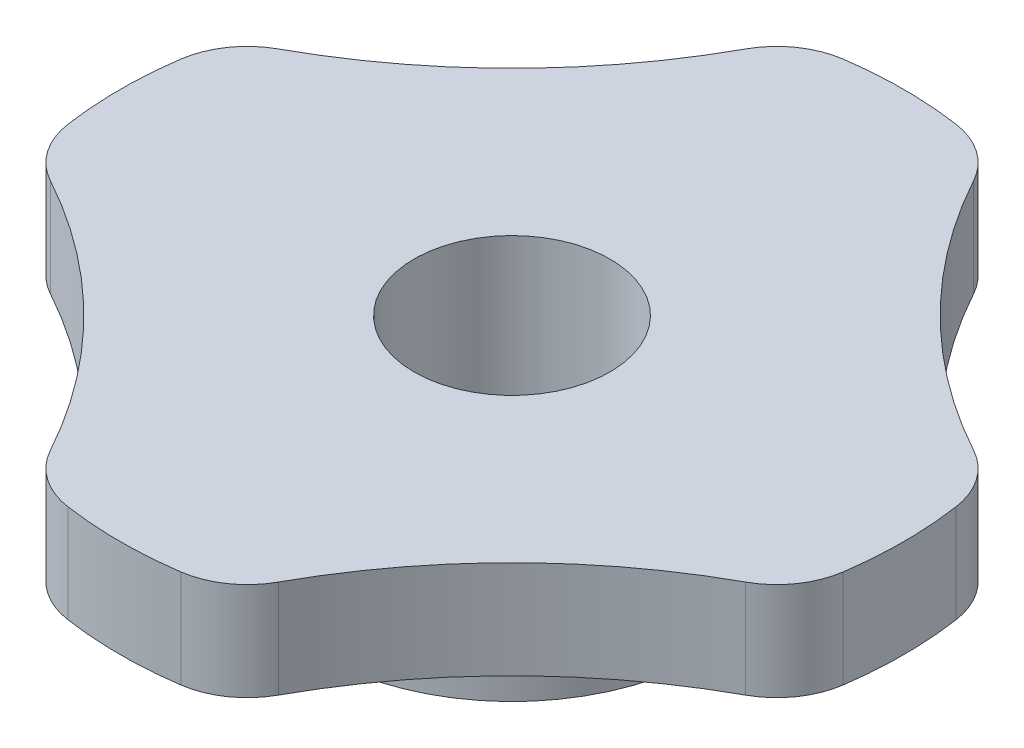
ISO-10303-21;
HEADER;
FILE_DESCRIPTION(('STEP AP214'),'2;1');
FILE_NAME('part.step','',(''),(''),'','','');
FILE_SCHEMA(('AUTOMOTIVE_DESIGN { 1 0 10303 214 1 1 1 1 }'));
ENDSEC;
DATA;
#1=APPLICATION_CONTEXT('core data for automotive mechanical design processes');
#2=APPLICATION_PROTOCOL_DEFINITION('international standard','automotive_design',2000,#1);
#3=PRODUCT_CONTEXT('',#1,'mechanical');
#4=PRODUCT('Part','Part','',(#3));
#5=PRODUCT_RELATED_PRODUCT_CATEGORY('part','',(#4));
#6=PRODUCT_DEFINITION_FORMATION('','',#4);
#7=PRODUCT_DEFINITION_CONTEXT('part definition',#1,'design');
#8=PRODUCT_DEFINITION('design','',#6,#7);
#9=PRODUCT_DEFINITION_SHAPE('','',#8);
#10=(LENGTH_UNIT() NAMED_UNIT(*) SI_UNIT(.MILLI.,.METRE.));
#11=(NAMED_UNIT(*) PLANE_ANGLE_UNIT() SI_UNIT($,.RADIAN.));
#12=(NAMED_UNIT(*) SI_UNIT($,.STERADIAN.) SOLID_ANGLE_UNIT());
#13=UNCERTAINTY_MEASURE_WITH_UNIT(LENGTH_MEASURE(1.E-05),#10,'distance_accuracy_value','');
#14=(GEOMETRIC_REPRESENTATION_CONTEXT(3) GLOBAL_UNCERTAINTY_ASSIGNED_CONTEXT((#13)) GLOBAL_UNIT_ASSIGNED_CONTEXT((#10,
#11,#12)) REPRESENTATION_CONTEXT('',''));
#15=CARTESIAN_POINT('',(0.,0.,0.));
#16=DIRECTION('',(0.,0.,1.));
#17=DIRECTION('',(1.,0.,0.));
#18=AXIS2_PLACEMENT_3D('',#15,#16,#17);
#19=CARTESIAN_POINT('',(0.,3.175,0.));
#20=DIRECTION('',(0.,-1.,0.));
#21=DIRECTION('',(0.,0.,-1.));
#22=AXIS2_PLACEMENT_3D('',#19,#20,#21);
#23=CYLINDRICAL_SURFACE('',#22,12.7);
#24=CARTESIAN_POINT('',(0.,3.175,0.));
#25=DIRECTION('',(0.,1.,0.));
#26=DIRECTION('',(0.,0.,1.));
#27=AXIS2_PLACEMENT_3D('',#24,#25,#26);
#28=CIRCLE('',#27,12.7);
#29=CARTESIAN_POINT('',(1.83384169491819,3.175,-12.566901950679));
#30=VERTEX_POINT('',#29);
#31=CARTESIAN_POINT('',(-1.83384169491815,3.175,-12.566901950679));
#32=VERTEX_POINT('',#31);
#33=EDGE_CURVE('E187',#30,#32,#28,.T.);
#34=ORIENTED_EDGE('',*,*,#33,.F.);
#35=DIRECTION('',(0.,-1.,0.));
#36=VECTOR('',#35,1.);
#37=CARTESIAN_POINT('',(1.83384169491819,3.175,-12.566901950679));
#38=LINE('',#37,#36);
#39=CARTESIAN_POINT('',(1.83384169491819,0.,-12.566901950679));
#40=VERTEX_POINT('',#39);
#41=EDGE_CURVE('E11',#30,#40,#38,.T.);
#42=ORIENTED_EDGE('',*,*,#41,.T.);
#43=CARTESIAN_POINT('',(0.,0.,0.));
#44=DIRECTION('',(0.,1.,0.));
#45=DIRECTION('',(0.,0.,1.));
#46=AXIS2_PLACEMENT_3D('',#43,#44,#45);
#47=CIRCLE('',#46,12.7);
#48=CARTESIAN_POINT('',(-1.83384169491815,0.,-12.566901950679));
#49=VERTEX_POINT('',#48);
#50=EDGE_CURVE('E287',#40,#49,#47,.T.);
#51=ORIENTED_EDGE('',*,*,#50,.T.);
#52=DIRECTION('',(0.,-1.,0.));
#53=VECTOR('',#52,1.);
#54=CARTESIAN_POINT('',(-1.83384169491815,3.175,-12.566901950679));
#55=LINE('',#54,#53);
#56=EDGE_CURVE('E50',#49,#32,#55,.F.);
#57=ORIENTED_EDGE('',*,*,#56,.T.);
#58=EDGE_LOOP('',(#34,#42,#51,#57));
#59=FACE_BOUND('',#58,.T.);
#60=ADVANCED_FACE('F41',(#59),#23,.T.);
#61=CARTESIAN_POINT('',(-20.4106311338721,3.175,-20.4106311338721));
#62=DIRECTION('',(0.,-1.,0.));
#63=DIRECTION('',(0.,0.,-1.));
#64=AXIS2_PLACEMENT_3D('',#61,#62,#63);
#65=CYLINDRICAL_SURFACE('',#64,19.05);
#66=CARTESIAN_POINT('',(-20.4106311338721,0.,-20.4106311338721));
#67=DIRECTION('',(0.,1.,0.));
#68=DIRECTION('',(0.,0.,1.));
#69=AXIS2_PLACEMENT_3D('',#66,#67,#68);
#70=CIRCLE('',#69,19.05);
#71=CARTESIAN_POINT('',(-3.69572721216247,0.,-11.2720050397584));
#72=VERTEX_POINT('',#71);
#73=CARTESIAN_POINT('',(-11.2720050397584,0.,-3.69572721216247));
#74=VERTEX_POINT('',#73);
#75=EDGE_CURVE('E301',#72,#74,#70,.F.);
#76=ORIENTED_EDGE('',*,*,#75,.T.);
#77=DIRECTION('',(0.,-1.,0.));
#78=VECTOR('',#77,1.);
#79=CARTESIAN_POINT('',(-11.2720050397584,3.175,-3.69572721216247));
#80=LINE('',#79,#78);
#81=CARTESIAN_POINT('',(-11.2720050397584,3.175,-3.69572721216247));
#82=VERTEX_POINT('',#81);
#83=EDGE_CURVE('E279',#74,#82,#80,.F.);
#84=ORIENTED_EDGE('',*,*,#83,.T.);
#85=CARTESIAN_POINT('',(-20.4106311338721,3.175,-20.4106311338721));
#86=DIRECTION('',(0.,1.,0.));
#87=DIRECTION('',(0.,0.,1.));
#88=AXIS2_PLACEMENT_3D('',#85,#86,#87);
#89=CIRCLE('',#88,19.05);
#90=CARTESIAN_POINT('',(-3.69572721216247,3.175,-11.2720050397584));
#91=VERTEX_POINT('',#90);
#92=EDGE_CURVE('E193',#91,#82,#89,.F.);
#93=ORIENTED_EDGE('',*,*,#92,.F.);
#94=DIRECTION('',(0.,-1.,0.));
#95=VECTOR('',#94,1.);
#96=CARTESIAN_POINT('',(-3.69572721216247,3.175,-11.2720050397584));
#97=LINE('',#96,#95);
#98=EDGE_CURVE('E275',#91,#72,#97,.T.);
#99=ORIENTED_EDGE('',*,*,#98,.T.);
#100=EDGE_LOOP('',(#76,#84,#93,#99));
#101=FACE_BOUND('',#100,.T.);
#102=ADVANCED_FACE('F300',(#101),#65,.F.);
#103=CARTESIAN_POINT('',(0.,3.175,0.));
#104=DIRECTION('',(0.,-1.,0.));
#105=DIRECTION('',(0.,0.,-1.));
#106=AXIS2_PLACEMENT_3D('',#103,#104,#105);
#107=CYLINDRICAL_SURFACE('',#106,12.7);
#108=CARTESIAN_POINT('',(0.,0.,0.));
#109=DIRECTION('',(0.,1.,0.));
#110=DIRECTION('',(0.,0.,1.));
#111=AXIS2_PLACEMENT_3D('',#108,#109,#110);
#112=CIRCLE('',#111,12.7);
#113=CARTESIAN_POINT('',(-12.566901950679,0.,-1.83384169491815));
#114=VERTEX_POINT('',#113);
#115=CARTESIAN_POINT('',(-12.566901950679,0.,1.83384169491801));
#116=VERTEX_POINT('',#115);
#117=EDGE_CURVE('E305',#114,#116,#112,.T.);
#118=ORIENTED_EDGE('',*,*,#117,.T.);
#119=DIRECTION('',(0.,-1.,0.));
#120=VECTOR('',#119,1.);
#121=CARTESIAN_POINT('',(-12.566901950679,3.175,1.83384169491801));
#122=LINE('',#121,#120);
#123=CARTESIAN_POINT('',(-12.566901950679,3.175,1.83384169491801));
#124=VERTEX_POINT('',#123);
#125=EDGE_CURVE('E272',#116,#124,#122,.F.);
#126=ORIENTED_EDGE('',*,*,#125,.T.);
#127=CARTESIAN_POINT('',(0.,3.175,0.));
#128=DIRECTION('',(0.,1.,0.));
#129=DIRECTION('',(0.,0.,1.));
#130=AXIS2_PLACEMENT_3D('',#127,#128,#129);
#131=CIRCLE('',#130,12.7);
#132=CARTESIAN_POINT('',(-12.566901950679,3.175,-1.83384169491815));
#133=VERTEX_POINT('',#132);
#134=EDGE_CURVE('E583',#133,#124,#131,.T.);
#135=ORIENTED_EDGE('',*,*,#134,.F.);
#136=DIRECTION('',(0.,-1.,0.));
#137=VECTOR('',#136,1.);
#138=CARTESIAN_POINT('',(-12.566901950679,3.175,-1.83384169491815));
#139=LINE('',#138,#137);
#140=EDGE_CURVE('E268',#133,#114,#139,.T.);
#141=ORIENTED_EDGE('',*,*,#140,.T.);
#142=EDGE_LOOP('',(#118,#126,#135,#141));
#143=FACE_BOUND('',#142,.T.);
#144=ADVANCED_FACE('F365',(#143),#107,.T.);
#145=CARTESIAN_POINT('',(-20.4106311338723,3.175,20.4106311338719));
#146=DIRECTION('',(0.,-1.,0.));
#147=DIRECTION('',(0.,0.,-1.));
#148=AXIS2_PLACEMENT_3D('',#145,#146,#147);
#149=CYLINDRICAL_SURFACE('',#148,19.05);
#150=CARTESIAN_POINT('',(-20.4106311338723,0.,20.4106311338719));
#151=DIRECTION('',(0.,1.,0.));
#152=DIRECTION('',(0.,0.,1.));
#153=AXIS2_PLACEMENT_3D('',#150,#151,#152);
#154=CIRCLE('',#153,19.05);
#155=CARTESIAN_POINT('',(-11.2720050397584,0.,3.69572721216234));
#156=VERTEX_POINT('',#155);
#157=CARTESIAN_POINT('',(-3.69572721216258,0.,11.2720050397583));
#158=VERTEX_POINT('',#157);
#159=EDGE_CURVE('E310',#156,#158,#154,.F.);
#160=ORIENTED_EDGE('',*,*,#159,.T.);
#161=DIRECTION('',(0.,-1.,0.));
#162=VECTOR('',#161,1.);
#163=CARTESIAN_POINT('',(-3.69572721216258,3.175,11.2720050397583));
#164=LINE('',#163,#162);
#165=CARTESIAN_POINT('',(-3.69572721216258,3.175,11.2720050397583));
#166=VERTEX_POINT('',#165);
#167=EDGE_CURVE('E265',#158,#166,#164,.F.);
#168=ORIENTED_EDGE('',*,*,#167,.T.);
#169=CARTESIAN_POINT('',(-20.4106311338723,3.175,20.4106311338719));
#170=DIRECTION('',(0.,1.,0.));
#171=DIRECTION('',(0.,0.,1.));
#172=AXIS2_PLACEMENT_3D('',#169,#170,#171);
#173=CIRCLE('',#172,19.05);
#174=CARTESIAN_POINT('',(-11.2720050397584,3.175,3.69572721216234));
#175=VERTEX_POINT('',#174);
#176=EDGE_CURVE('E587',#175,#166,#173,.F.);
#177=ORIENTED_EDGE('',*,*,#176,.F.);
#178=DIRECTION('',(0.,-1.,0.));
#179=VECTOR('',#178,1.);
#180=CARTESIAN_POINT('',(-11.2720050397584,3.175,3.69572721216234));
#181=LINE('',#180,#179);
#182=EDGE_CURVE('E261',#175,#156,#181,.T.);
#183=ORIENTED_EDGE('',*,*,#182,.T.);
#184=EDGE_LOOP('',(#160,#168,#177,#183));
#185=FACE_BOUND('',#184,.T.);
#186=ADVANCED_FACE('F489',(#185),#149,.F.);
#187=CARTESIAN_POINT('',(0.,3.175,0.));
#188=DIRECTION('',(0.,-1.,0.));
#189=DIRECTION('',(0.,0.,-1.));
#190=AXIS2_PLACEMENT_3D('',#187,#188,#189);
#191=CYLINDRICAL_SURFACE('',#190,12.7);
#192=CARTESIAN_POINT('',(0.,0.,0.));
#193=DIRECTION('',(0.,1.,0.));
#194=DIRECTION('',(0.,0.,1.));
#195=AXIS2_PLACEMENT_3D('',#192,#193,#194);
#196=CIRCLE('',#195,12.7);
#197=CARTESIAN_POINT('',(-1.83384169491827,0.,12.566901950679));
#198=VERTEX_POINT('',#197);
#199=CARTESIAN_POINT('',(1.83384169491842,0.,12.566901950679));
#200=VERTEX_POINT('',#199);
#201=EDGE_CURVE('E319',#198,#200,#196,.T.);
#202=ORIENTED_EDGE('',*,*,#201,.T.);
#203=DIRECTION('',(0.,-1.,0.));
#204=VECTOR('',#203,1.);
#205=CARTESIAN_POINT('',(1.83384169491842,3.175,12.566901950679));
#206=LINE('',#205,#204);
#207=CARTESIAN_POINT('',(1.83384169491842,3.175,12.566901950679));
#208=VERTEX_POINT('',#207);
#209=EDGE_CURVE('E258',#200,#208,#206,.F.);
#210=ORIENTED_EDGE('',*,*,#209,.T.);
#211=CARTESIAN_POINT('',(0.,3.175,0.));
#212=DIRECTION('',(0.,1.,0.));
#213=DIRECTION('',(0.,0.,1.));
#214=AXIS2_PLACEMENT_3D('',#211,#212,#213);
#215=CIRCLE('',#214,12.7);
#216=CARTESIAN_POINT('',(-1.83384169491827,3.175,12.566901950679));
#217=VERTEX_POINT('',#216);
#218=EDGE_CURVE('E340',#217,#208,#215,.T.);
#219=ORIENTED_EDGE('',*,*,#218,.F.);
#220=DIRECTION('',(0.,-1.,0.));
#221=VECTOR('',#220,1.);
#222=CARTESIAN_POINT('',(-1.83384169491827,3.175,12.566901950679));
#223=LINE('',#222,#221);
#224=EDGE_CURVE('E254',#217,#198,#223,.T.);
#225=ORIENTED_EDGE('',*,*,#224,.T.);
#226=EDGE_LOOP('',(#202,#210,#219,#225));
#227=FACE_BOUND('',#226,.T.);
#228=ADVANCED_FACE('F480',(#227),#191,.T.);
#229=CARTESIAN_POINT('',(20.4106311338728,3.175,20.4106311338719));
#230=DIRECTION('',(0.,-1.,0.));
#231=DIRECTION('',(0.,0.,-1.));
#232=AXIS2_PLACEMENT_3D('',#229,#230,#231);
#233=CYLINDRICAL_SURFACE('',#232,19.0500000000004);
#234=CARTESIAN_POINT('',(20.4106311338728,0.,20.4106311338719));
#235=DIRECTION('',(0.,1.,0.));
#236=DIRECTION('',(0.,0.,1.));
#237=AXIS2_PLACEMENT_3D('',#234,#235,#236);
#238=CIRCLE('',#237,19.0500000000004);
#239=CARTESIAN_POINT('',(3.6957272121627,0.,11.2720050397583));
#240=VERTEX_POINT('',#239);
#241=CARTESIAN_POINT('',(11.2720050397585,0.,3.69572721216222));
#242=VERTEX_POINT('',#241);
#243=EDGE_CURVE('E195',#240,#242,#238,.F.);
#244=ORIENTED_EDGE('',*,*,#243,.T.);
#245=DIRECTION('',(0.,-1.,0.));
#246=VECTOR('',#245,1.);
#247=CARTESIAN_POINT('',(11.2720050397585,3.175,3.69572721216221));
#248=LINE('',#247,#246);
#249=CARTESIAN_POINT('',(11.2720050397585,3.175,3.69572721216222));
#250=VERTEX_POINT('',#249);
#251=EDGE_CURVE('E57',#242,#250,#248,.F.);
#252=ORIENTED_EDGE('',*,*,#251,.T.);
#253=CARTESIAN_POINT('',(20.4106311338728,3.175,20.4106311338719));
#254=DIRECTION('',(0.,1.,0.));
#255=DIRECTION('',(0.,0.,1.));
#256=AXIS2_PLACEMENT_3D('',#253,#254,#255);
#257=CIRCLE('',#256,19.0500000000004);
#258=CARTESIAN_POINT('',(3.6957272121627,3.175,11.2720050397583));
#259=VERTEX_POINT('',#258);
#260=EDGE_CURVE('E332',#259,#250,#257,.F.);
#261=ORIENTED_EDGE('',*,*,#260,.F.);
#262=DIRECTION('',(0.,-1.,0.));
#263=VECTOR('',#262,1.);
#264=CARTESIAN_POINT('',(3.6957272121627,3.175,11.2720050397583));
#265=LINE('',#264,#263);
#266=EDGE_CURVE('E248',#259,#240,#265,.T.);
#267=ORIENTED_EDGE('',*,*,#266,.T.);
#268=EDGE_LOOP('',(#244,#252,#261,#267));
#269=FACE_BOUND('',#268,.T.);
#270=ADVANCED_FACE('F324',(#269),#233,.F.);
#271=CARTESIAN_POINT('',(0.,3.175,0.));
#272=DIRECTION('',(0.,-1.,0.));
#273=DIRECTION('',(0.,0.,-1.));
#274=AXIS2_PLACEMENT_3D('',#271,#272,#273);
#275=CYLINDRICAL_SURFACE('',#274,12.7);
#276=CARTESIAN_POINT('',(0.,0.,0.));
#277=DIRECTION('',(0.,1.,0.));
#278=DIRECTION('',(0.,0.,1.));
#279=AXIS2_PLACEMENT_3D('',#276,#277,#278);
#280=CIRCLE('',#279,12.7);
#281=CARTESIAN_POINT('',(12.566901950679,0.,1.83384169491787));
#282=VERTEX_POINT('',#281);
#283=CARTESIAN_POINT('',(12.566901950679,0.,-1.8338416949181));
#284=VERTEX_POINT('',#283);
#285=EDGE_CURVE('E188',#282,#284,#280,.T.);
#286=ORIENTED_EDGE('',*,*,#285,.T.);
#287=DIRECTION('',(0.,-1.,0.));
#288=VECTOR('',#287,1.);
#289=CARTESIAN_POINT('',(12.566901950679,3.175,-1.8338416949181));
#290=LINE('',#289,#288);
#291=CARTESIAN_POINT('',(12.566901950679,3.175,-1.8338416949181));
#292=VERTEX_POINT('',#291);
#293=EDGE_CURVE('E162',#284,#292,#290,.F.);
#294=ORIENTED_EDGE('',*,*,#293,.T.);
#295=CARTESIAN_POINT('',(0.,3.175,0.));
#296=DIRECTION('',(0.,1.,0.));
#297=DIRECTION('',(0.,0.,1.));
#298=AXIS2_PLACEMENT_3D('',#295,#296,#297);
#299=CIRCLE('',#298,12.7);
#300=CARTESIAN_POINT('',(12.566901950679,3.175,1.83384169491787));
#301=VERTEX_POINT('',#300);
#302=EDGE_CURVE('E331',#301,#292,#299,.T.);
#303=ORIENTED_EDGE('',*,*,#302,.F.);
#304=DIRECTION('',(0.,-1.,0.));
#305=VECTOR('',#304,1.);
#306=CARTESIAN_POINT('',(12.566901950679,3.175,1.83384169491787));
#307=LINE('',#306,#305);
#308=EDGE_CURVE('E168',#301,#282,#307,.T.);
#309=ORIENTED_EDGE('',*,*,#308,.T.);
#310=EDGE_LOOP('',(#286,#294,#303,#309));
#311=FACE_BOUND('',#310,.T.);
#312=ADVANCED_FACE('F334',(#311),#275,.T.);
#313=CARTESIAN_POINT('',(20.4106311338722,3.175,-20.410631133872));
#314=DIRECTION('',(0.,-1.,0.));
#315=DIRECTION('',(0.,0.,-1.));
#316=AXIS2_PLACEMENT_3D('',#313,#314,#315);
#317=CYLINDRICAL_SURFACE('',#316,19.05);
#318=CARTESIAN_POINT('',(20.4106311338722,3.175,-20.410631133872));
#319=DIRECTION('',(0.,1.,0.));
#320=DIRECTION('',(0.,0.,1.));
#321=AXIS2_PLACEMENT_3D('',#318,#319,#320);
#322=CIRCLE('',#321,19.05);
#323=CARTESIAN_POINT('',(11.2720050397584,3.175,-3.69572721216243));
#324=VERTEX_POINT('',#323);
#325=CARTESIAN_POINT('',(3.69572721216251,3.175,-11.2720050397584));
#326=VERTEX_POINT('',#325);
#327=EDGE_CURVE('E178',#324,#326,#322,.F.);
#328=ORIENTED_EDGE('',*,*,#327,.F.);
#329=DIRECTION('',(0.,-1.,0.));
#330=VECTOR('',#329,1.);
#331=CARTESIAN_POINT('',(11.2720050397584,3.175,-3.69572721216243));
#332=LINE('',#331,#330);
#333=CARTESIAN_POINT('',(11.2720050397584,0.,-3.69572721216243));
#334=VERTEX_POINT('',#333);
#335=EDGE_CURVE('E161',#324,#334,#332,.T.);
#336=ORIENTED_EDGE('',*,*,#335,.T.);
#337=CARTESIAN_POINT('',(20.4106311338722,0.,-20.410631133872));
#338=DIRECTION('',(0.,1.,0.));
#339=DIRECTION('',(0.,0.,1.));
#340=AXIS2_PLACEMENT_3D('',#337,#338,#339);
#341=CIRCLE('',#340,19.05);
#342=CARTESIAN_POINT('',(3.69572721216251,0.,-11.2720050397584));
#343=VERTEX_POINT('',#342);
#344=EDGE_CURVE('E175',#334,#343,#341,.F.);
#345=ORIENTED_EDGE('',*,*,#344,.T.);
#346=DIRECTION('',(0.,-1.,0.));
#347=VECTOR('',#346,1.);
#348=CARTESIAN_POINT('',(3.69572721216251,3.175,-11.2720050397584));
#349=LINE('',#348,#347);
#350=EDGE_CURVE('E181',#343,#326,#349,.F.);
#351=ORIENTED_EDGE('',*,*,#350,.T.);
#352=EDGE_LOOP('',(#328,#336,#345,#351));
#353=FACE_BOUND('',#352,.T.);
#354=ADVANCED_FACE('F174',(#353),#317,.F.);
#355=CARTESIAN_POINT('',(0.,3.175,0.));
#356=DIRECTION('',(0.,-1.,0.));
#357=DIRECTION('',(0.,0.,-1.));
#358=AXIS2_PLACEMENT_3D('',#355,#356,#357);
#359=CYLINDRICAL_SURFACE('',#358,3.175);
#360=CARTESIAN_POINT('',(0.,3.175,0.));
#361=DIRECTION('',(0.,1.,0.));
#362=DIRECTION('',(0.,0.,1.));
#363=AXIS2_PLACEMENT_3D('',#360,#361,#362);
#364=CIRCLE('',#363,3.175);
#365=CARTESIAN_POINT('',(0.,3.175,3.175));
#366=VERTEX_POINT('',#365);
#367=EDGE_CURVE('E200',#366,#366,#364,.T.);
#368=ORIENTED_EDGE('',*,*,#367,.T.);
#369=EDGE_LOOP('',(#368));
#370=FACE_BOUND('',#369,.T.);
#371=CARTESIAN_POINT('',(0.,-3.175,0.));
#372=DIRECTION('',(0.,1.,0.));
#373=DIRECTION('',(0.,0.,1.));
#374=AXIS2_PLACEMENT_3D('',#371,#372,#373);
#375=CIRCLE('',#374,3.175);
#376=CARTESIAN_POINT('',(0.,-3.175,3.175));
#377=VERTEX_POINT('',#376);
#378=EDGE_CURVE('E312',#377,#377,#375,.T.);
#379=ORIENTED_EDGE('',*,*,#378,.F.);
#380=EDGE_LOOP('',(#379));
#381=FACE_BOUND('',#380,.T.);
#382=ADVANCED_FACE('F347',(#370,#381),#359,.F.);
#383=CARTESIAN_POINT('',(0.,3.175,0.));
#384=DIRECTION('',(0.,1.,0.));
#385=DIRECTION('',(0.,0.,1.));
#386=AXIS2_PLACEMENT_3D('',#383,#384,#385);
#387=PLANE('',#386);
#388=ORIENTED_EDGE('',*,*,#302,.T.);
#389=CARTESIAN_POINT('',(10.0535215605432,3.175,-1.46707335593448));
#390=DIRECTION('',(0.,1.,0.));
#391=DIRECTION('',(0.,0.,1.));
#392=AXIS2_PLACEMENT_3D('',#389,#390,#391);
#393=CIRCLE('',#392,2.54);
#394=EDGE_CURVE('E245',#292,#324,#393,.T.);
#395=ORIENTED_EDGE('',*,*,#394,.T.);
#396=ORIENTED_EDGE('',*,*,#327,.T.);
#397=CARTESIAN_POINT('',(1.46707335593455,3.175,-10.0535215605432));
#398=DIRECTION('',(0.,1.,0.));
#399=DIRECTION('',(0.,0.,1.));
#400=AXIS2_PLACEMENT_3D('',#397,#398,#399);
#401=CIRCLE('',#400,2.54);
#402=EDGE_CURVE('E228',#326,#30,#401,.T.);
#403=ORIENTED_EDGE('',*,*,#402,.T.);
#404=ORIENTED_EDGE('',*,*,#33,.T.);
#405=CARTESIAN_POINT('',(-1.46707335593452,3.175,-10.0535215605432));
#406=DIRECTION('',(0.,1.,0.));
#407=DIRECTION('',(0.,0.,1.));
#408=AXIS2_PLACEMENT_3D('',#405,#406,#407);
#409=CIRCLE('',#408,2.54);
#410=EDGE_CURVE('E225',#32,#91,#409,.T.);
#411=ORIENTED_EDGE('',*,*,#410,.T.);
#412=ORIENTED_EDGE('',*,*,#92,.T.);
#413=CARTESIAN_POINT('',(-10.0535215605432,3.175,-1.46707335593452));
#414=DIRECTION('',(0.,1.,0.));
#415=DIRECTION('',(0.,0.,1.));
#416=AXIS2_PLACEMENT_3D('',#413,#414,#415);
#417=CIRCLE('',#416,2.54);
#418=EDGE_CURVE('E231',#82,#133,#417,.T.);
#419=ORIENTED_EDGE('',*,*,#418,.T.);
#420=ORIENTED_EDGE('',*,*,#134,.T.);
#421=CARTESIAN_POINT('',(-10.0535215605432,3.175,1.46707335593441));
#422=DIRECTION('',(0.,1.,0.));
#423=DIRECTION('',(0.,0.,1.));
#424=AXIS2_PLACEMENT_3D('',#421,#422,#423);
#425=CIRCLE('',#424,2.54);
#426=EDGE_CURVE('E234',#124,#175,#425,.T.);
#427=ORIENTED_EDGE('',*,*,#426,.T.);
#428=ORIENTED_EDGE('',*,*,#176,.T.);
#429=CARTESIAN_POINT('',(-1.46707335593462,3.175,10.0535215605432));
#430=DIRECTION('',(0.,1.,0.));
#431=DIRECTION('',(0.,0.,1.));
#432=AXIS2_PLACEMENT_3D('',#429,#430,#431);
#433=CIRCLE('',#432,2.54);
#434=EDGE_CURVE('E237',#166,#217,#433,.T.);
#435=ORIENTED_EDGE('',*,*,#434,.T.);
#436=ORIENTED_EDGE('',*,*,#218,.T.);
#437=CARTESIAN_POINT('',(1.46707335593473,3.175,10.0535215605432));
#438=DIRECTION('',(0.,1.,0.));
#439=DIRECTION('',(0.,0.,1.));
#440=AXIS2_PLACEMENT_3D('',#437,#438,#439);
#441=CIRCLE('',#440,2.54);
#442=EDGE_CURVE('E64',#208,#259,#441,.T.);
#443=ORIENTED_EDGE('',*,*,#442,.T.);
#444=ORIENTED_EDGE('',*,*,#260,.T.);
#445=CARTESIAN_POINT('',(10.0535215605432,3.175,1.4670733559343));
#446=DIRECTION('',(0.,1.,0.));
#447=DIRECTION('',(0.,0.,1.));
#448=AXIS2_PLACEMENT_3D('',#445,#446,#447);
#449=CIRCLE('',#448,2.54);
#450=EDGE_CURVE('E242',#250,#301,#449,.T.);
#451=ORIENTED_EDGE('',*,*,#450,.T.);
#452=EDGE_LOOP('',(#388,#395,#396,#403,#404,#411,#412,#419,#420,#427,#428,#435,#436,#443,#444,#451));
#453=FACE_BOUND('',#452,.T.);
#454=ORIENTED_EDGE('',*,*,#367,.F.);
#455=EDGE_LOOP('',(#454));
#456=FACE_BOUND('',#455,.T.);
#457=ADVANCED_FACE('F291',(#453,#456),#387,.T.);
#458=CARTESIAN_POINT('',(0.,0.,0.));
#459=DIRECTION('',(0.,1.,0.));
#460=DIRECTION('',(0.,0.,1.));
#461=AXIS2_PLACEMENT_3D('',#458,#459,#460);
#462=PLANE('',#461);
#463=CARTESIAN_POINT('',(0.,0.,0.));
#464=DIRECTION('',(0.,1.,0.));
#465=DIRECTION('',(0.,0.,1.));
#466=AXIS2_PLACEMENT_3D('',#463,#464,#465);
#467=CIRCLE('',#466,6.35);
#468=CARTESIAN_POINT('',(0.,0.,6.35));
#469=VERTEX_POINT('',#468);
#470=EDGE_CURVE('E574',#469,#469,#467,.T.);
#471=ORIENTED_EDGE('',*,*,#470,.T.);
#472=EDGE_LOOP('',(#471));
#473=FACE_BOUND('',#472,.T.);
#474=ORIENTED_EDGE('',*,*,#344,.F.);
#475=CARTESIAN_POINT('',(10.0535215605432,0.,-1.46707335593448));
#476=DIRECTION('',(0.,1.,0.));
#477=DIRECTION('',(0.,0.,1.));
#478=AXIS2_PLACEMENT_3D('',#475,#476,#477);
#479=CIRCLE('',#478,2.54);
#480=EDGE_CURVE('E157',#334,#284,#479,.F.);
#481=ORIENTED_EDGE('',*,*,#480,.T.);
#482=ORIENTED_EDGE('',*,*,#285,.F.);
#483=CARTESIAN_POINT('',(10.0535215605432,0.,1.4670733559343));
#484=DIRECTION('',(0.,1.,0.));
#485=DIRECTION('',(0.,0.,1.));
#486=AXIS2_PLACEMENT_3D('',#483,#484,#485);
#487=CIRCLE('',#486,2.54);
#488=EDGE_CURVE('E169',#282,#242,#487,.F.);
#489=ORIENTED_EDGE('',*,*,#488,.T.);
#490=ORIENTED_EDGE('',*,*,#243,.F.);
#491=CARTESIAN_POINT('',(1.46707335593473,0.,10.0535215605432));
#492=DIRECTION('',(0.,1.,0.));
#493=DIRECTION('',(0.,0.,1.));
#494=AXIS2_PLACEMENT_3D('',#491,#492,#493);
#495=CIRCLE('',#494,2.54);
#496=EDGE_CURVE('E215',#240,#200,#495,.F.);
#497=ORIENTED_EDGE('',*,*,#496,.T.);
#498=ORIENTED_EDGE('',*,*,#201,.F.);
#499=CARTESIAN_POINT('',(-1.46707335593462,0.,10.0535215605432));
#500=DIRECTION('',(0.,1.,0.));
#501=DIRECTION('',(0.,0.,1.));
#502=AXIS2_PLACEMENT_3D('',#499,#500,#501);
#503=CIRCLE('',#502,2.54);
#504=EDGE_CURVE('E212',#198,#158,#503,.F.);
#505=ORIENTED_EDGE('',*,*,#504,.T.);
#506=ORIENTED_EDGE('',*,*,#159,.F.);
#507=CARTESIAN_POINT('',(-10.0535215605432,0.,1.46707335593441));
#508=DIRECTION('',(0.,1.,0.));
#509=DIRECTION('',(0.,0.,1.));
#510=AXIS2_PLACEMENT_3D('',#507,#508,#509);
#511=CIRCLE('',#510,2.54);
#512=EDGE_CURVE('E209',#156,#116,#511,.F.);
#513=ORIENTED_EDGE('',*,*,#512,.T.);
#514=ORIENTED_EDGE('',*,*,#117,.F.);
#515=CARTESIAN_POINT('',(-10.0535215605432,0.,-1.46707335593452));
#516=DIRECTION('',(0.,1.,0.));
#517=DIRECTION('',(0.,0.,1.));
#518=AXIS2_PLACEMENT_3D('',#515,#516,#517);
#519=CIRCLE('',#518,2.54);
#520=EDGE_CURVE('E206',#114,#74,#519,.F.);
#521=ORIENTED_EDGE('',*,*,#520,.T.);
#522=ORIENTED_EDGE('',*,*,#75,.F.);
#523=CARTESIAN_POINT('',(-1.46707335593452,0.,-10.0535215605432));
#524=DIRECTION('',(0.,1.,0.));
#525=DIRECTION('',(0.,0.,1.));
#526=AXIS2_PLACEMENT_3D('',#523,#524,#525);
#527=CIRCLE('',#526,2.54);
#528=EDGE_CURVE('E180',#72,#49,#527,.F.);
#529=ORIENTED_EDGE('',*,*,#528,.T.);
#530=ORIENTED_EDGE('',*,*,#50,.F.);
#531=CARTESIAN_POINT('',(1.46707335593455,0.,-10.0535215605432));
#532=DIRECTION('',(0.,1.,0.));
#533=DIRECTION('',(0.,0.,1.));
#534=AXIS2_PLACEMENT_3D('',#531,#532,#533);
#535=CIRCLE('',#534,2.54);
#536=EDGE_CURVE('E185',#40,#343,#535,.F.);
#537=ORIENTED_EDGE('',*,*,#536,.T.);
#538=EDGE_LOOP('',(#474,#481,#482,#489,#490,#497,#498,#505,#506,#513,#514,#521,#522,#529,#530,#537));
#539=FACE_BOUND('',#538,.T.);
#540=ADVANCED_FACE('F183',(#473,#539),#462,.F.);
#541=CARTESIAN_POINT('',(0.,-3.175,0.));
#542=DIRECTION('',(0.,1.,0.));
#543=DIRECTION('',(0.,0.,1.));
#544=AXIS2_PLACEMENT_3D('',#541,#542,#543);
#545=CYLINDRICAL_SURFACE('',#544,6.35);
#546=CARTESIAN_POINT('',(0.,-3.175,0.));
#547=DIRECTION('',(0.,1.,0.));
#548=DIRECTION('',(0.,0.,1.));
#549=AXIS2_PLACEMENT_3D('',#546,#547,#548);
#550=CIRCLE('',#549,6.35);
#551=CARTESIAN_POINT('',(0.,-3.175,6.35));
#552=VERTEX_POINT('',#551);
#553=EDGE_CURVE('E571',#552,#552,#550,.T.);
#554=ORIENTED_EDGE('',*,*,#553,.T.);
#555=EDGE_LOOP('',(#554));
#556=FACE_BOUND('',#555,.T.);
#557=ORIENTED_EDGE('',*,*,#470,.F.);
#558=EDGE_LOOP('',(#557));
#559=FACE_BOUND('',#558,.T.);
#560=ADVANCED_FACE('F355',(#556,#559),#545,.T.);
#561=CARTESIAN_POINT('',(0.,-3.175,0.));
#562=DIRECTION('',(0.,1.,0.));
#563=DIRECTION('',(0.,0.,1.));
#564=AXIS2_PLACEMENT_3D('',#561,#562,#563);
#565=PLANE('',#564);
#566=ORIENTED_EDGE('',*,*,#553,.F.);
#567=EDGE_LOOP('',(#566));
#568=FACE_BOUND('',#567,.T.);
#569=ORIENTED_EDGE('',*,*,#378,.T.);
#570=EDGE_LOOP('',(#569));
#571=FACE_BOUND('',#570,.T.);
#572=ADVANCED_FACE('F371',(#568,#571),#565,.F.);
#573=CARTESIAN_POINT('',(10.0535215605432,3.175,-1.46707335593448));
#574=DIRECTION('',(0.,1.,0.));
#575=DIRECTION('',(0.,0.,1.));
#576=AXIS2_PLACEMENT_3D('',#573,#574,#575);
#577=CYLINDRICAL_SURFACE('',#576,2.54);
#578=ORIENTED_EDGE('',*,*,#394,.F.);
#579=ORIENTED_EDGE('',*,*,#293,.F.);
#580=ORIENTED_EDGE('',*,*,#480,.F.);
#581=ORIENTED_EDGE('',*,*,#335,.F.);
#582=EDGE_LOOP('',(#578,#579,#580,#581));
#583=FACE_BOUND('',#582,.T.);
#584=ADVANCED_FACE('F160',(#583),#577,.T.);
#585=CARTESIAN_POINT('',(10.0535215605432,3.175,1.4670733559343));
#586=DIRECTION('',(0.,1.,0.));
#587=DIRECTION('',(0.,0.,1.));
#588=AXIS2_PLACEMENT_3D('',#585,#586,#587);
#589=CYLINDRICAL_SURFACE('',#588,2.54);
#590=ORIENTED_EDGE('',*,*,#450,.F.);
#591=ORIENTED_EDGE('',*,*,#251,.F.);
#592=ORIENTED_EDGE('',*,*,#488,.F.);
#593=ORIENTED_EDGE('',*,*,#308,.F.);
#594=EDGE_LOOP('',(#590,#591,#592,#593));
#595=FACE_BOUND('',#594,.T.);
#596=ADVANCED_FACE('F328',(#595),#589,.T.);
#597=CARTESIAN_POINT('',(1.46707335593473,3.175,10.0535215605432));
#598=DIRECTION('',(0.,1.,0.));
#599=DIRECTION('',(0.,0.,1.));
#600=AXIS2_PLACEMENT_3D('',#597,#598,#599);
#601=CYLINDRICAL_SURFACE('',#600,2.54);
#602=ORIENTED_EDGE('',*,*,#442,.F.);
#603=ORIENTED_EDGE('',*,*,#209,.F.);
#604=ORIENTED_EDGE('',*,*,#496,.F.);
#605=ORIENTED_EDGE('',*,*,#266,.F.);
#606=EDGE_LOOP('',(#602,#603,#604,#605));
#607=FACE_BOUND('',#606,.T.);
#608=ADVANCED_FACE('F374',(#607),#601,.T.);
#609=CARTESIAN_POINT('',(-1.46707335593462,3.175,10.0535215605432));
#610=DIRECTION('',(0.,1.,0.));
#611=DIRECTION('',(0.,0.,1.));
#612=AXIS2_PLACEMENT_3D('',#609,#610,#611);
#613=CYLINDRICAL_SURFACE('',#612,2.54);
#614=ORIENTED_EDGE('',*,*,#434,.F.);
#615=ORIENTED_EDGE('',*,*,#167,.F.);
#616=ORIENTED_EDGE('',*,*,#504,.F.);
#617=ORIENTED_EDGE('',*,*,#224,.F.);
#618=EDGE_LOOP('',(#614,#615,#616,#617));
#619=FACE_BOUND('',#618,.T.);
#620=ADVANCED_FACE('F377',(#619),#613,.T.);
#621=CARTESIAN_POINT('',(-10.0535215605432,3.175,1.46707335593441));
#622=DIRECTION('',(0.,1.,0.));
#623=DIRECTION('',(0.,0.,1.));
#624=AXIS2_PLACEMENT_3D('',#621,#622,#623);
#625=CYLINDRICAL_SURFACE('',#624,2.54);
#626=ORIENTED_EDGE('',*,*,#426,.F.);
#627=ORIENTED_EDGE('',*,*,#125,.F.);
#628=ORIENTED_EDGE('',*,*,#512,.F.);
#629=ORIENTED_EDGE('',*,*,#182,.F.);
#630=EDGE_LOOP('',(#626,#627,#628,#629));
#631=FACE_BOUND('',#630,.T.);
#632=ADVANCED_FACE('F381',(#631),#625,.T.);
#633=CARTESIAN_POINT('',(-10.0535215605432,3.175,-1.46707335593452));
#634=DIRECTION('',(0.,1.,0.));
#635=DIRECTION('',(0.,0.,1.));
#636=AXIS2_PLACEMENT_3D('',#633,#634,#635);
#637=CYLINDRICAL_SURFACE('',#636,2.54);
#638=ORIENTED_EDGE('',*,*,#418,.F.);
#639=ORIENTED_EDGE('',*,*,#83,.F.);
#640=ORIENTED_EDGE('',*,*,#520,.F.);
#641=ORIENTED_EDGE('',*,*,#140,.F.);
#642=EDGE_LOOP('',(#638,#639,#640,#641));
#643=FACE_BOUND('',#642,.T.);
#644=ADVANCED_FACE('F385',(#643),#637,.T.);
#645=CARTESIAN_POINT('',(1.46707335593455,3.175,-10.0535215605432));
#646=DIRECTION('',(0.,1.,0.));
#647=DIRECTION('',(0.,0.,1.));
#648=AXIS2_PLACEMENT_3D('',#645,#646,#647);
#649=CYLINDRICAL_SURFACE('',#648,2.54);
#650=ORIENTED_EDGE('',*,*,#402,.F.);
#651=ORIENTED_EDGE('',*,*,#350,.F.);
#652=ORIENTED_EDGE('',*,*,#536,.F.);
#653=ORIENTED_EDGE('',*,*,#41,.F.);
#654=EDGE_LOOP('',(#650,#651,#652,#653));
#655=FACE_BOUND('',#654,.T.);
#656=ADVANCED_FACE('F388',(#655),#649,.T.);
#657=CARTESIAN_POINT('',(-1.46707335593452,3.175,-10.0535215605432));
#658=DIRECTION('',(0.,1.,0.));
#659=DIRECTION('',(0.,0.,1.));
#660=AXIS2_PLACEMENT_3D('',#657,#658,#659);
#661=CYLINDRICAL_SURFACE('',#660,2.54);
#662=ORIENTED_EDGE('',*,*,#410,.F.);
#663=ORIENTED_EDGE('',*,*,#56,.F.);
#664=ORIENTED_EDGE('',*,*,#528,.F.);
#665=ORIENTED_EDGE('',*,*,#98,.F.);
#666=EDGE_LOOP('',(#662,#663,#664,#665));
#667=FACE_BOUND('',#666,.T.);
#668=ADVANCED_FACE('F43',(#667),#661,.T.);
#669=CLOSED_SHELL('',(#60,#102,#144,#186,#228,#270,#312,#354,#382,#457,#540,#560,#572,#584,#596,
#608,#620,#632,#644,#656,#668));
#670=MANIFOLD_SOLID_BREP('B2',#669);
#671=ADVANCED_BREP_SHAPE_REPRESENTATION('',(#18,#670),#14);
#672=SHAPE_DEFINITION_REPRESENTATION(#9,#671);
ENDSEC;
END-ISO-10303-21;
